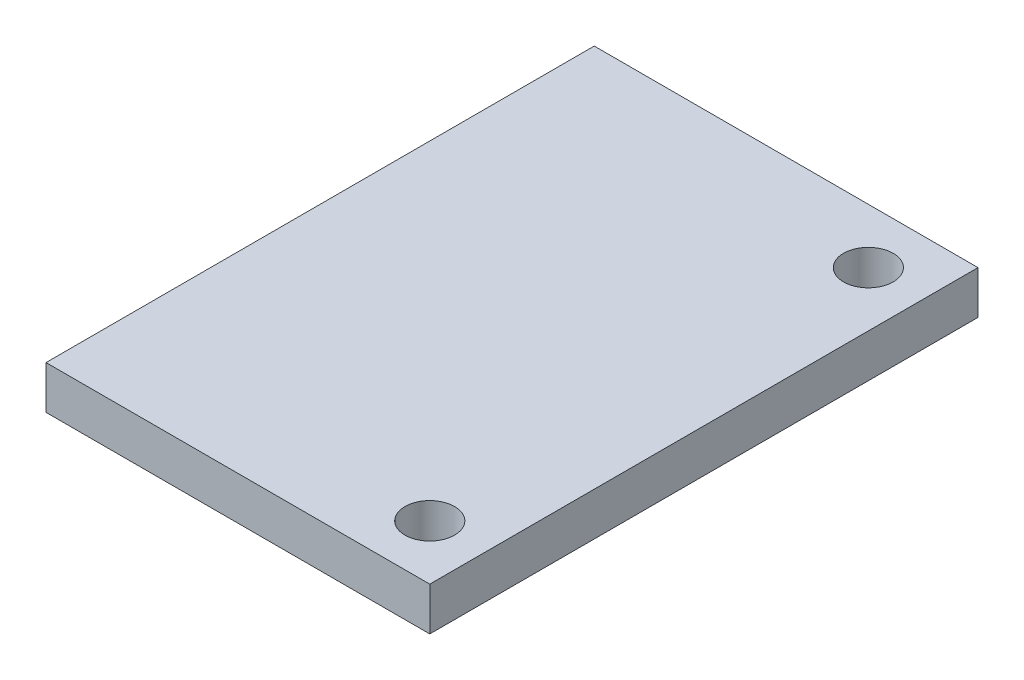
ISO-10303-21;
HEADER;
FILE_DESCRIPTION(('STEP AP214'),'2;1');
FILE_NAME('part.step','',(''),(''),'','','');
FILE_SCHEMA(('AUTOMOTIVE_DESIGN { 1 0 10303 214 1 1 1 1 }'));
ENDSEC;
DATA;
#1=APPLICATION_CONTEXT('core data for automotive mechanical design processes');
#2=APPLICATION_PROTOCOL_DEFINITION('international standard','automotive_design',2000,#1);
#3=PRODUCT_CONTEXT('',#1,'mechanical');
#4=PRODUCT('Part','Part','',(#3));
#5=PRODUCT_RELATED_PRODUCT_CATEGORY('part','',(#4));
#6=PRODUCT_DEFINITION_FORMATION('','',#4);
#7=PRODUCT_DEFINITION_CONTEXT('part definition',#1,'design');
#8=PRODUCT_DEFINITION('design','',#6,#7);
#9=PRODUCT_DEFINITION_SHAPE('','',#8);
#10=(LENGTH_UNIT() NAMED_UNIT(*) SI_UNIT(.MILLI.,.METRE.));
#11=(NAMED_UNIT(*) PLANE_ANGLE_UNIT() SI_UNIT($,.RADIAN.));
#12=(NAMED_UNIT(*) SI_UNIT($,.STERADIAN.) SOLID_ANGLE_UNIT());
#13=UNCERTAINTY_MEASURE_WITH_UNIT(LENGTH_MEASURE(1.E-05),#10,'distance_accuracy_value','');
#14=(GEOMETRIC_REPRESENTATION_CONTEXT(3) GLOBAL_UNCERTAINTY_ASSIGNED_CONTEXT((#13)) GLOBAL_UNIT_ASSIGNED_CONTEXT((#10,
#11,#12)) REPRESENTATION_CONTEXT('',''));
#15=CARTESIAN_POINT('',(0.,0.,0.));
#16=DIRECTION('',(0.,0.,1.));
#17=DIRECTION('',(1.,0.,0.));
#18=AXIS2_PLACEMENT_3D('',#15,#16,#17);
#19=CARTESIAN_POINT('',(8.89,2.,-12.7));
#20=DIRECTION('',(-1.,0.,0.));
#21=DIRECTION('',(0.,0.,1.));
#22=AXIS2_PLACEMENT_3D('',#19,#20,#21);
#23=PLANE('',#22);
#24=DIRECTION('',(0.,0.,-1.));
#25=VECTOR('',#24,1.);
#26=CARTESIAN_POINT('',(8.89,0.,-12.7));
#27=LINE('',#26,#25);
#28=CARTESIAN_POINT('',(8.89,0.,12.7));
#29=VERTEX_POINT('',#28);
#30=CARTESIAN_POINT('',(8.89,0.,-12.7));
#31=VERTEX_POINT('',#30);
#32=EDGE_CURVE('E96',#29,#31,#27,.T.);
#33=ORIENTED_EDGE('',*,*,#32,.T.);
#34=DIRECTION('',(0.,-1.,0.));
#35=VECTOR('',#34,1.);
#36=CARTESIAN_POINT('',(8.89,2.,-12.7));
#37=LINE('',#36,#35);
#38=CARTESIAN_POINT('',(8.89,2.,-12.7));
#39=VERTEX_POINT('',#38);
#40=EDGE_CURVE('E11',#39,#31,#37,.T.);
#41=ORIENTED_EDGE('',*,*,#40,.F.);
#42=DIRECTION('',(0.,0.,-1.));
#43=VECTOR('',#42,1.);
#44=CARTESIAN_POINT('',(8.89,2.,-12.7));
#45=LINE('',#44,#43);
#46=CARTESIAN_POINT('',(8.89,2.,12.7));
#47=VERTEX_POINT('',#46);
#48=EDGE_CURVE('E84',#47,#39,#45,.T.);
#49=ORIENTED_EDGE('',*,*,#48,.F.);
#50=DIRECTION('',(0.,-1.,0.));
#51=VECTOR('',#50,1.);
#52=CARTESIAN_POINT('',(8.89,2.,12.7));
#53=LINE('',#52,#51);
#54=EDGE_CURVE('E92',#47,#29,#53,.T.);
#55=ORIENTED_EDGE('',*,*,#54,.T.);
#56=EDGE_LOOP('',(#33,#41,#49,#55));
#57=FACE_BOUND('',#56,.T.);
#58=ADVANCED_FACE('F33',(#57),#23,.F.);
#59=CARTESIAN_POINT('',(-8.89,2.,-12.7));
#60=DIRECTION('',(0.,0.,1.));
#61=DIRECTION('',(1.,0.,0.));
#62=AXIS2_PLACEMENT_3D('',#59,#60,#61);
#63=PLANE('',#62);
#64=DIRECTION('',(-1.,0.,0.));
#65=VECTOR('',#64,1.);
#66=CARTESIAN_POINT('',(-8.89,0.,-12.7));
#67=LINE('',#66,#65);
#68=CARTESIAN_POINT('',(-8.89,0.,-12.7));
#69=VERTEX_POINT('',#68);
#70=EDGE_CURVE('E88',#31,#69,#67,.T.);
#71=ORIENTED_EDGE('',*,*,#70,.T.);
#72=DIRECTION('',(0.,-1.,0.));
#73=VECTOR('',#72,1.);
#74=CARTESIAN_POINT('',(-8.89,2.,-12.7));
#75=LINE('',#74,#73);
#76=CARTESIAN_POINT('',(-8.89,2.,-12.7));
#77=VERTEX_POINT('',#76);
#78=EDGE_CURVE('E41',#77,#69,#75,.T.);
#79=ORIENTED_EDGE('',*,*,#78,.F.);
#80=DIRECTION('',(-1.,0.,0.));
#81=VECTOR('',#80,1.);
#82=CARTESIAN_POINT('',(-8.89,2.,-12.7));
#83=LINE('',#82,#81);
#84=EDGE_CURVE('E79',#39,#77,#83,.T.);
#85=ORIENTED_EDGE('',*,*,#84,.F.);
#86=ORIENTED_EDGE('',*,*,#40,.T.);
#87=EDGE_LOOP('',(#71,#79,#85,#86));
#88=FACE_BOUND('',#87,.T.);
#89=ADVANCED_FACE('F87',(#88),#63,.F.);
#90=CARTESIAN_POINT('',(-8.89,2.,-12.7));
#91=DIRECTION('',(1.,0.,0.));
#92=DIRECTION('',(0.,0.,-1.));
#93=AXIS2_PLACEMENT_3D('',#90,#91,#92);
#94=PLANE('',#93);
#95=DIRECTION('',(0.,0.,1.));
#96=VECTOR('',#95,1.);
#97=CARTESIAN_POINT('',(-8.89,0.,-12.7));
#98=LINE('',#97,#96);
#99=CARTESIAN_POINT('',(-8.89,0.,12.7));
#100=VERTEX_POINT('',#99);
#101=EDGE_CURVE('E66',#69,#100,#98,.T.);
#102=ORIENTED_EDGE('',*,*,#101,.T.);
#103=DIRECTION('',(0.,-1.,0.));
#104=VECTOR('',#103,1.);
#105=CARTESIAN_POINT('',(-8.89,2.,12.7));
#106=LINE('',#105,#104);
#107=CARTESIAN_POINT('',(-8.89,2.,12.7));
#108=VERTEX_POINT('',#107);
#109=EDGE_CURVE('E89',#108,#100,#106,.T.);
#110=ORIENTED_EDGE('',*,*,#109,.F.);
#111=DIRECTION('',(0.,0.,1.));
#112=VECTOR('',#111,1.);
#113=CARTESIAN_POINT('',(-8.89,2.,-12.7));
#114=LINE('',#113,#112);
#115=EDGE_CURVE('E82',#77,#108,#114,.T.);
#116=ORIENTED_EDGE('',*,*,#115,.F.);
#117=ORIENTED_EDGE('',*,*,#78,.T.);
#118=EDGE_LOOP('',(#102,#110,#116,#117));
#119=FACE_BOUND('',#118,.T.);
#120=ADVANCED_FACE('F90',(#119),#94,.F.);
#121=CARTESIAN_POINT('',(-8.89,2.,12.7));
#122=DIRECTION('',(0.,0.,-1.));
#123=DIRECTION('',(-1.,0.,0.));
#124=AXIS2_PLACEMENT_3D('',#121,#122,#123);
#125=PLANE('',#124);
#126=DIRECTION('',(1.,0.,0.));
#127=VECTOR('',#126,1.);
#128=CARTESIAN_POINT('',(-8.89,0.,12.7));
#129=LINE('',#128,#127);
#130=EDGE_CURVE('E72',#100,#29,#129,.T.);
#131=ORIENTED_EDGE('',*,*,#130,.T.);
#132=ORIENTED_EDGE('',*,*,#54,.F.);
#133=DIRECTION('',(1.,0.,0.));
#134=VECTOR('',#133,1.);
#135=CARTESIAN_POINT('',(-8.89,2.,12.7));
#136=LINE('',#135,#134);
#137=EDGE_CURVE('E49',#108,#47,#136,.T.);
#138=ORIENTED_EDGE('',*,*,#137,.F.);
#139=ORIENTED_EDGE('',*,*,#109,.T.);
#140=EDGE_LOOP('',(#131,#132,#138,#139));
#141=FACE_BOUND('',#140,.T.);
#142=ADVANCED_FACE('F104',(#141),#125,.F.);
#143=CARTESIAN_POINT('',(0.,2.,0.));
#144=DIRECTION('',(0.,1.,0.));
#145=DIRECTION('',(0.,0.,1.));
#146=AXIS2_PLACEMENT_3D('',#143,#144,#145);
#147=PLANE('',#146);
#148=CARTESIAN_POINT('',(6.35,2.,-10.16));
#149=DIRECTION('',(0.,1.,0.));
#150=DIRECTION('',(0.,0.,1.));
#151=AXIS2_PLACEMENT_3D('',#148,#149,#150);
#152=CIRCLE('',#151,1.15);
#153=CARTESIAN_POINT('',(6.35,2.,-9.01));
#154=VERTEX_POINT('',#153);
#155=EDGE_CURVE('E113',#154,#154,#152,.T.);
#156=ORIENTED_EDGE('',*,*,#155,.F.);
#157=EDGE_LOOP('',(#156));
#158=FACE_BOUND('',#157,.T.);
#159=CARTESIAN_POINT('',(6.35,2.,10.16));
#160=DIRECTION('',(0.,1.,0.));
#161=DIRECTION('',(0.,0.,1.));
#162=AXIS2_PLACEMENT_3D('',#159,#160,#161);
#163=CIRCLE('',#162,1.15);
#164=CARTESIAN_POINT('',(6.35,2.,11.31));
#165=VERTEX_POINT('',#164);
#166=EDGE_CURVE('E114',#165,#165,#163,.T.);
#167=ORIENTED_EDGE('',*,*,#166,.F.);
#168=EDGE_LOOP('',(#167));
#169=FACE_BOUND('',#168,.T.);
#170=ORIENTED_EDGE('',*,*,#48,.T.);
#171=ORIENTED_EDGE('',*,*,#84,.T.);
#172=ORIENTED_EDGE('',*,*,#115,.T.);
#173=ORIENTED_EDGE('',*,*,#137,.T.);
#174=EDGE_LOOP('',(#170,#171,#172,#173));
#175=FACE_BOUND('',#174,.T.);
#176=ADVANCED_FACE('F80',(#158,#169,#175),#147,.T.);
#177=CARTESIAN_POINT('',(0.,0.,0.));
#178=DIRECTION('',(0.,1.,0.));
#179=DIRECTION('',(0.,0.,1.));
#180=AXIS2_PLACEMENT_3D('',#177,#178,#179);
#181=PLANE('',#180);
#182=CARTESIAN_POINT('',(6.35,0.,-10.16));
#183=DIRECTION('',(0.,1.,0.));
#184=DIRECTION('',(0.,0.,1.));
#185=AXIS2_PLACEMENT_3D('',#182,#183,#184);
#186=CIRCLE('',#185,1.15);
#187=CARTESIAN_POINT('',(6.35,0.,-9.01));
#188=VERTEX_POINT('',#187);
#189=EDGE_CURVE('E99',#188,#188,#186,.F.);
#190=ORIENTED_EDGE('',*,*,#189,.F.);
#191=EDGE_LOOP('',(#190));
#192=FACE_BOUND('',#191,.T.);
#193=CARTESIAN_POINT('',(6.35,0.,10.16));
#194=DIRECTION('',(0.,1.,0.));
#195=DIRECTION('',(0.,0.,1.));
#196=AXIS2_PLACEMENT_3D('',#193,#194,#195);
#197=CIRCLE('',#196,1.15);
#198=CARTESIAN_POINT('',(6.35,0.,11.31));
#199=VERTEX_POINT('',#198);
#200=EDGE_CURVE('E110',#199,#199,#197,.F.);
#201=ORIENTED_EDGE('',*,*,#200,.F.);
#202=EDGE_LOOP('',(#201));
#203=FACE_BOUND('',#202,.T.);
#204=ORIENTED_EDGE('',*,*,#32,.F.);
#205=ORIENTED_EDGE('',*,*,#130,.F.);
#206=ORIENTED_EDGE('',*,*,#101,.F.);
#207=ORIENTED_EDGE('',*,*,#70,.F.);
#208=EDGE_LOOP('',(#204,#205,#206,#207));
#209=FACE_BOUND('',#208,.T.);
#210=ADVANCED_FACE('F107',(#192,#203,#209),#181,.F.);
#211=CARTESIAN_POINT('',(6.35,-3.25269119345812,10.16));
#212=DIRECTION('',(0.,1.,0.));
#213=DIRECTION('',(0.,0.,1.));
#214=AXIS2_PLACEMENT_3D('',#211,#212,#213);
#215=CYLINDRICAL_SURFACE('',#214,1.15);
#216=ORIENTED_EDGE('',*,*,#200,.T.);
#217=EDGE_LOOP('',(#216));
#218=FACE_BOUND('',#217,.T.);
#219=ORIENTED_EDGE('',*,*,#166,.T.);
#220=EDGE_LOOP('',(#219));
#221=FACE_BOUND('',#220,.T.);
#222=ADVANCED_FACE('F129',(#218,#221),#215,.F.);
#223=CARTESIAN_POINT('',(6.35,-3.25269119345812,-10.16));
#224=DIRECTION('',(0.,1.,0.));
#225=DIRECTION('',(0.,0.,1.));
#226=AXIS2_PLACEMENT_3D('',#223,#224,#225);
#227=CYLINDRICAL_SURFACE('',#226,1.15);
#228=ORIENTED_EDGE('',*,*,#189,.T.);
#229=EDGE_LOOP('',(#228));
#230=FACE_BOUND('',#229,.T.);
#231=ORIENTED_EDGE('',*,*,#155,.T.);
#232=EDGE_LOOP('',(#231));
#233=FACE_BOUND('',#232,.T.);
#234=ADVANCED_FACE('F122',(#230,#233),#227,.F.);
#235=CLOSED_SHELL('',(#58,#89,#120,#142,#176,#210,#222,#234));
#236=MANIFOLD_SOLID_BREP('B2',#235);
#237=ADVANCED_BREP_SHAPE_REPRESENTATION('',(#18,#236),#14);
#238=SHAPE_DEFINITION_REPRESENTATION(#9,#237);
ENDSEC;
END-ISO-10303-21;
